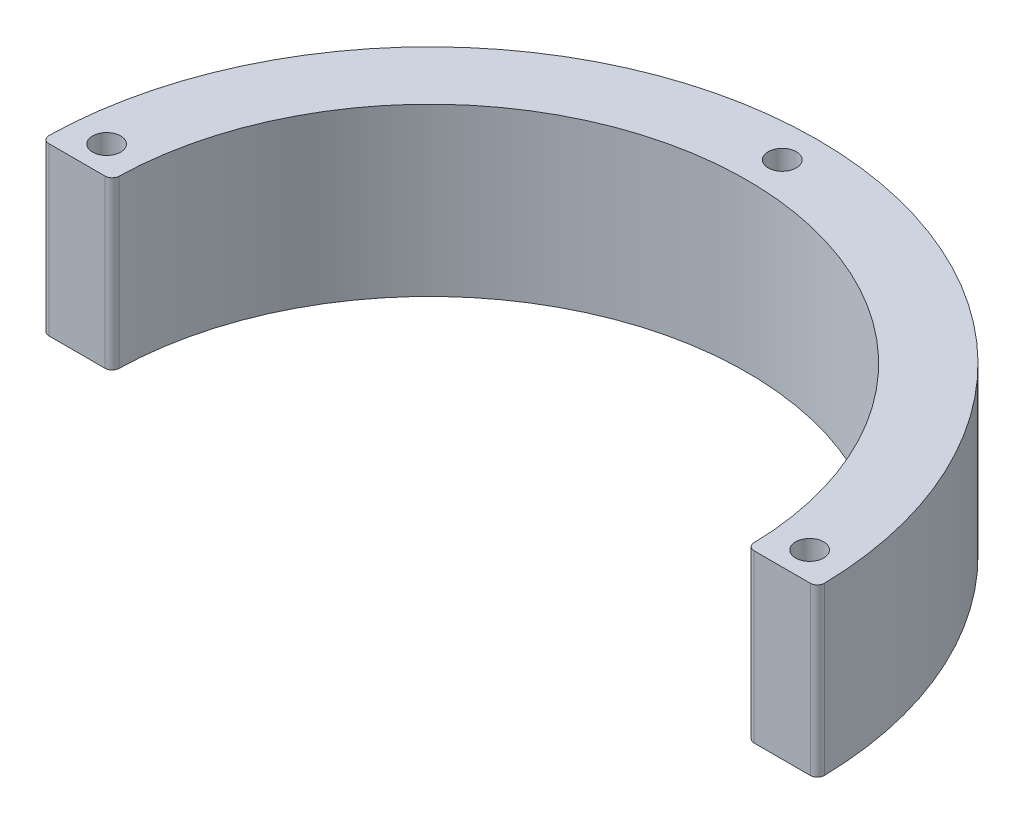
ISO-10303-21;
HEADER;
FILE_DESCRIPTION(('STEP AP214'),'2;1');
FILE_NAME('part.step','',(''),(''),'','','');
FILE_SCHEMA(('AUTOMOTIVE_DESIGN { 1 0 10303 214 1 1 1 1 }'));
ENDSEC;
DATA;
#1=APPLICATION_CONTEXT('core data for automotive mechanical design processes');
#2=APPLICATION_PROTOCOL_DEFINITION('international standard','automotive_design',2000,#1);
#3=PRODUCT_CONTEXT('',#1,'mechanical');
#4=PRODUCT('Part','Part','',(#3));
#5=PRODUCT_RELATED_PRODUCT_CATEGORY('part','',(#4));
#6=PRODUCT_DEFINITION_FORMATION('','',#4);
#7=PRODUCT_DEFINITION_CONTEXT('part definition',#1,'design');
#8=PRODUCT_DEFINITION('design','',#6,#7);
#9=PRODUCT_DEFINITION_SHAPE('','',#8);
#10=(LENGTH_UNIT() NAMED_UNIT(*) SI_UNIT(.MILLI.,.METRE.));
#11=(NAMED_UNIT(*) PLANE_ANGLE_UNIT() SI_UNIT($,.RADIAN.));
#12=(NAMED_UNIT(*) SI_UNIT($,.STERADIAN.) SOLID_ANGLE_UNIT());
#13=UNCERTAINTY_MEASURE_WITH_UNIT(LENGTH_MEASURE(1.E-05),#10,'distance_accuracy_value','');
#14=(GEOMETRIC_REPRESENTATION_CONTEXT(3) GLOBAL_UNCERTAINTY_ASSIGNED_CONTEXT((#13)) GLOBAL_UNIT_ASSIGNED_CONTEXT((#10,
#11,#12)) REPRESENTATION_CONTEXT('',''));
#15=CARTESIAN_POINT('',(0.,0.,0.));
#16=DIRECTION('',(0.,0.,1.));
#17=DIRECTION('',(1.,0.,0.));
#18=AXIS2_PLACEMENT_3D('',#15,#16,#17);
#19=CARTESIAN_POINT('',(0.,11.85,0.));
#20=DIRECTION('',(0.,-1.,0.));
#21=DIRECTION('',(0.,0.,-1.));
#22=AXIS2_PLACEMENT_3D('',#19,#20,#21);
#23=CYLINDRICAL_SURFACE('',#22,22.6);
#24=CARTESIAN_POINT('',(0.,0.,0.));
#25=DIRECTION('',(0.,-1.,0.));
#26=DIRECTION('',(0.,0.,1.));
#27=AXIS2_PLACEMENT_3D('',#24,#25,#26);
#28=CIRCLE('',#27,22.6);
#29=CARTESIAN_POINT('',(-22.5947052510999,0.,-0.489177489177489));
#30=VERTEX_POINT('',#29);
#31=CARTESIAN_POINT('',(22.5947052510999,0.,-0.489177489177489));
#32=VERTEX_POINT('',#31);
#33=EDGE_CURVE('E131',#30,#32,#28,.T.);
#34=ORIENTED_EDGE('',*,*,#33,.T.);
#35=DIRECTION('',(0.,-1.,0.));
#36=VECTOR('',#35,1.);
#37=CARTESIAN_POINT('',(22.5947052510999,11.85,-0.489177489177489));
#38=LINE('',#37,#36);
#39=CARTESIAN_POINT('',(22.5947052510999,11.85,-0.489177489177489));
#40=VERTEX_POINT('',#39);
#41=EDGE_CURVE('E154',#32,#40,#38,.F.);
#42=ORIENTED_EDGE('',*,*,#41,.T.);
#43=CARTESIAN_POINT('',(0.,11.85,0.));
#44=DIRECTION('',(0.,-1.,0.));
#45=DIRECTION('',(0.,0.,1.));
#46=AXIS2_PLACEMENT_3D('',#43,#44,#45);
#47=CIRCLE('',#46,22.6);
#48=CARTESIAN_POINT('',(-22.5947052510999,11.85,-0.489177489177489));
#49=VERTEX_POINT('',#48);
#50=EDGE_CURVE('E129',#49,#40,#47,.T.);
#51=ORIENTED_EDGE('',*,*,#50,.F.);
#52=DIRECTION('',(0.,-1.,0.));
#53=VECTOR('',#52,1.);
#54=CARTESIAN_POINT('',(-22.5947052510999,11.85,-0.489177489177489));
#55=LINE('',#54,#53);
#56=EDGE_CURVE('E151',#49,#30,#55,.T.);
#57=ORIENTED_EDGE('',*,*,#56,.T.);
#58=EDGE_LOOP('',(#34,#42,#51,#57));
#59=FACE_BOUND('',#58,.T.);
#60=ADVANCED_FACE('F36',(#59),#23,.F.);
#61=CARTESIAN_POINT('',(22.6,11.85,0.));
#62=DIRECTION('',(0.,0.,-1.));
#63=DIRECTION('',(-1.,0.,0.));
#64=AXIS2_PLACEMENT_3D('',#61,#62,#63);
#65=PLANE('',#64);
#66=DIRECTION('',(1.,0.,0.));
#67=VECTOR('',#66,1.);
#68=CARTESIAN_POINT('',(22.6,0.,0.));
#69=LINE('',#68,#67);
#70=CARTESIAN_POINT('',(23.0945881106375,0.,0.));
#71=VERTEX_POINT('',#70);
#72=CARTESIAN_POINT('',(27.0953870612693,0.,0.));
#73=VERTEX_POINT('',#72);
#74=EDGE_CURVE('E127',#71,#73,#69,.T.);
#75=ORIENTED_EDGE('',*,*,#74,.T.);
#76=DIRECTION('',(0.,-1.,0.));
#77=VECTOR('',#76,1.);
#78=CARTESIAN_POINT('',(27.0953870612693,11.85,0.));
#79=LINE('',#78,#77);
#80=CARTESIAN_POINT('',(27.0953870612693,11.85,0.));
#81=VERTEX_POINT('',#80);
#82=EDGE_CURVE('E106',#73,#81,#79,.F.);
#83=ORIENTED_EDGE('',*,*,#82,.T.);
#84=DIRECTION('',(1.,0.,0.));
#85=VECTOR('',#84,1.);
#86=CARTESIAN_POINT('',(22.6,11.85,0.));
#87=LINE('',#86,#85);
#88=CARTESIAN_POINT('',(23.0945881106375,11.85,0.));
#89=VERTEX_POINT('',#88);
#90=EDGE_CURVE('E170',#89,#81,#87,.T.);
#91=ORIENTED_EDGE('',*,*,#90,.F.);
#92=DIRECTION('',(0.,-1.,0.));
#93=VECTOR('',#92,1.);
#94=CARTESIAN_POINT('',(23.0945881106375,11.85,0.));
#95=LINE('',#94,#93);
#96=EDGE_CURVE('E111',#89,#71,#95,.T.);
#97=ORIENTED_EDGE('',*,*,#96,.T.);
#98=EDGE_LOOP('',(#75,#83,#91,#97));
#99=FACE_BOUND('',#98,.T.);
#100=ADVANCED_FACE('F209',(#99),#65,.F.);
#101=CARTESIAN_POINT('',(0.,11.85,0.));
#102=DIRECTION('',(0.,-1.,0.));
#103=DIRECTION('',(0.,0.,-1.));
#104=AXIS2_PLACEMENT_3D('',#101,#102,#103);
#105=CYLINDRICAL_SURFACE('',#104,27.6);
#106=CARTESIAN_POINT('',(0.,11.85,0.));
#107=DIRECTION('',(0.,1.,0.));
#108=DIRECTION('',(0.,0.,1.));
#109=AXIS2_PLACEMENT_3D('',#106,#107,#108);
#110=CIRCLE('',#109,27.6);
#111=CARTESIAN_POINT('',(27.5953019516986,11.85,-0.509225092250922));
#112=VERTEX_POINT('',#111);
#113=CARTESIAN_POINT('',(-27.5953019516986,11.85,-0.509225092250922));
#114=VERTEX_POINT('',#113);
#115=EDGE_CURVE('E120',#112,#114,#110,.T.);
#116=ORIENTED_EDGE('',*,*,#115,.F.);
#117=DIRECTION('',(0.,-1.,0.));
#118=VECTOR('',#117,1.);
#119=CARTESIAN_POINT('',(27.5953019516986,11.85,-0.509225092250923));
#120=LINE('',#119,#118);
#121=CARTESIAN_POINT('',(27.5953019516986,0.,-0.509225092250922));
#122=VERTEX_POINT('',#121);
#123=EDGE_CURVE('E105',#112,#122,#120,.T.);
#124=ORIENTED_EDGE('',*,*,#123,.T.);
#125=CARTESIAN_POINT('',(0.,0.,0.));
#126=DIRECTION('',(0.,1.,0.));
#127=DIRECTION('',(0.,0.,1.));
#128=AXIS2_PLACEMENT_3D('',#125,#126,#127);
#129=CIRCLE('',#128,27.6);
#130=CARTESIAN_POINT('',(-27.5953019516986,0.,-0.509225092250922));
#131=VERTEX_POINT('',#130);
#132=EDGE_CURVE('E118',#122,#131,#129,.T.);
#133=ORIENTED_EDGE('',*,*,#132,.T.);
#134=DIRECTION('',(0.,-1.,0.));
#135=VECTOR('',#134,1.);
#136=CARTESIAN_POINT('',(-27.5953019516986,11.85,-0.509225092250923));
#137=LINE('',#136,#135);
#138=EDGE_CURVE('E122',#131,#114,#137,.F.);
#139=ORIENTED_EDGE('',*,*,#138,.T.);
#140=EDGE_LOOP('',(#116,#124,#133,#139));
#141=FACE_BOUND('',#140,.T.);
#142=ADVANCED_FACE('F117',(#141),#105,.T.);
#143=CARTESIAN_POINT('',(-27.6,11.85,0.));
#144=DIRECTION('',(0.,0.,-1.));
#145=DIRECTION('',(-1.,0.,0.));
#146=AXIS2_PLACEMENT_3D('',#143,#144,#145);
#147=PLANE('',#146);
#148=DIRECTION('',(1.,0.,0.));
#149=VECTOR('',#148,1.);
#150=CARTESIAN_POINT('',(-27.6,0.,0.));
#151=LINE('',#150,#149);
#152=CARTESIAN_POINT('',(-27.0953870612693,0.,0.));
#153=VERTEX_POINT('',#152);
#154=CARTESIAN_POINT('',(-23.0945881106375,0.,0.));
#155=VERTEX_POINT('',#154);
#156=EDGE_CURVE('E126',#153,#155,#151,.T.);
#157=ORIENTED_EDGE('',*,*,#156,.T.);
#158=DIRECTION('',(0.,-1.,0.));
#159=VECTOR('',#158,1.);
#160=CARTESIAN_POINT('',(-23.0945881106375,11.85,0.));
#161=LINE('',#160,#159);
#162=CARTESIAN_POINT('',(-23.0945881106375,11.85,0.));
#163=VERTEX_POINT('',#162);
#164=EDGE_CURVE('E11',#155,#163,#161,.F.);
#165=ORIENTED_EDGE('',*,*,#164,.T.);
#166=DIRECTION('',(1.,0.,0.));
#167=VECTOR('',#166,1.);
#168=CARTESIAN_POINT('',(-27.6,11.85,0.));
#169=LINE('',#168,#167);
#170=CARTESIAN_POINT('',(-27.0953870612693,11.85,0.));
#171=VERTEX_POINT('',#170);
#172=EDGE_CURVE('E135',#171,#163,#169,.T.);
#173=ORIENTED_EDGE('',*,*,#172,.F.);
#174=DIRECTION('',(0.,-1.,0.));
#175=VECTOR('',#174,1.);
#176=CARTESIAN_POINT('',(-27.0953870612693,11.85,0.));
#177=LINE('',#176,#175);
#178=EDGE_CURVE('E44',#171,#153,#177,.T.);
#179=ORIENTED_EDGE('',*,*,#178,.T.);
#180=EDGE_LOOP('',(#157,#165,#173,#179));
#181=FACE_BOUND('',#180,.T.);
#182=ADVANCED_FACE('F157',(#181),#147,.F.);
#183=CARTESIAN_POINT('',(0.,11.85,0.));
#184=DIRECTION('',(0.,1.,0.));
#185=DIRECTION('',(0.,0.,1.));
#186=AXIS2_PLACEMENT_3D('',#183,#184,#185);
#187=PLANE('',#186);
#188=CARTESIAN_POINT('',(-25.0177384181239,11.85,-2.03045917031813));
#189=DIRECTION('',(0.,1.,0.));
#190=DIRECTION('',(0.,0.,1.));
#191=AXIS2_PLACEMENT_3D('',#188,#189,#190);
#192=CIRCLE('',#191,1.);
#193=CARTESIAN_POINT('',(-25.0177384181239,11.85,-1.03045917031813));
#194=VERTEX_POINT('',#193);
#195=EDGE_CURVE('E181',#194,#194,#192,.T.);
#196=ORIENTED_EDGE('',*,*,#195,.F.);
#197=EDGE_LOOP('',(#196));
#198=FACE_BOUND('',#197,.T.);
#199=CARTESIAN_POINT('',(25.0177384181239,11.85,-2.03045917031804));
#200=DIRECTION('',(0.,1.,0.));
#201=DIRECTION('',(0.,0.,1.));
#202=AXIS2_PLACEMENT_3D('',#199,#200,#201);
#203=CIRCLE('',#202,1.);
#204=CARTESIAN_POINT('',(25.0177384181239,11.85,-1.03045917031804));
#205=VERTEX_POINT('',#204);
#206=EDGE_CURVE('E191',#205,#205,#203,.T.);
#207=ORIENTED_EDGE('',*,*,#206,.F.);
#208=EDGE_LOOP('',(#207));
#209=FACE_BOUND('',#208,.T.);
#210=CARTESIAN_POINT('',(0.,11.85,-25.1));
#211=DIRECTION('',(0.,1.,0.));
#212=DIRECTION('',(0.,0.,1.));
#213=AXIS2_PLACEMENT_3D('',#210,#211,#212);
#214=CIRCLE('',#213,1.);
#215=CARTESIAN_POINT('',(0.,11.85,-24.1));
#216=VERTEX_POINT('',#215);
#217=EDGE_CURVE('E175',#216,#216,#214,.T.);
#218=ORIENTED_EDGE('',*,*,#217,.F.);
#219=EDGE_LOOP('',(#218));
#220=FACE_BOUND('',#219,.T.);
#221=ORIENTED_EDGE('',*,*,#90,.T.);
#222=CARTESIAN_POINT('',(27.0953870612693,11.85,-0.5));
#223=DIRECTION('',(0.,1.,0.));
#224=DIRECTION('',(0.,0.,1.));
#225=AXIS2_PLACEMENT_3D('',#222,#223,#224);
#226=CIRCLE('',#225,0.5);
#227=EDGE_CURVE('E149',#81,#112,#226,.T.);
#228=ORIENTED_EDGE('',*,*,#227,.T.);
#229=ORIENTED_EDGE('',*,*,#115,.T.);
#230=CARTESIAN_POINT('',(-27.0953870612693,11.85,-0.5));
#231=DIRECTION('',(0.,1.,0.));
#232=DIRECTION('',(0.,0.,1.));
#233=AXIS2_PLACEMENT_3D('',#230,#231,#232);
#234=CIRCLE('',#233,0.5);
#235=EDGE_CURVE('E56',#114,#171,#234,.T.);
#236=ORIENTED_EDGE('',*,*,#235,.T.);
#237=ORIENTED_EDGE('',*,*,#172,.T.);
#238=CARTESIAN_POINT('',(-23.0945881106375,11.85,-0.5));
#239=DIRECTION('',(0.,1.,0.));
#240=DIRECTION('',(0.,0.,1.));
#241=AXIS2_PLACEMENT_3D('',#238,#239,#240);
#242=CIRCLE('',#241,0.5);
#243=EDGE_CURVE('E145',#163,#49,#242,.T.);
#244=ORIENTED_EDGE('',*,*,#243,.T.);
#245=ORIENTED_EDGE('',*,*,#50,.T.);
#246=CARTESIAN_POINT('',(23.0945881106375,11.85,-0.5));
#247=DIRECTION('',(0.,1.,0.));
#248=DIRECTION('',(0.,0.,1.));
#249=AXIS2_PLACEMENT_3D('',#246,#247,#248);
#250=CIRCLE('',#249,0.5);
#251=EDGE_CURVE('E147',#40,#89,#250,.T.);
#252=ORIENTED_EDGE('',*,*,#251,.T.);
#253=EDGE_LOOP('',(#221,#228,#229,#236,#237,#244,#245,#252));
#254=FACE_BOUND('',#253,.T.);
#255=ADVANCED_FACE('F202',(#198,#209,#220,#254),#187,.T.);
#256=CARTESIAN_POINT('',(0.,0.,0.));
#257=DIRECTION('',(0.,1.,0.));
#258=DIRECTION('',(0.,0.,1.));
#259=AXIS2_PLACEMENT_3D('',#256,#257,#258);
#260=PLANE('',#259);
#261=CARTESIAN_POINT('',(-25.0177384181239,0.,-2.03045917031813));
#262=DIRECTION('',(0.,1.,0.));
#263=DIRECTION('',(0.,0.,1.));
#264=AXIS2_PLACEMENT_3D('',#261,#262,#263);
#265=CIRCLE('',#264,1.);
#266=CARTESIAN_POINT('',(-25.0177384181239,0.,-1.03045917031813));
#267=VERTEX_POINT('',#266);
#268=EDGE_CURVE('E179',#267,#267,#265,.T.);
#269=ORIENTED_EDGE('',*,*,#268,.T.);
#270=EDGE_LOOP('',(#269));
#271=FACE_BOUND('',#270,.T.);
#272=CARTESIAN_POINT('',(25.0177384181239,0.,-2.03045917031804));
#273=DIRECTION('',(0.,1.,0.));
#274=DIRECTION('',(0.,0.,1.));
#275=AXIS2_PLACEMENT_3D('',#272,#273,#274);
#276=CIRCLE('',#275,1.);
#277=CARTESIAN_POINT('',(25.0177384181239,0.,-1.03045917031804));
#278=VERTEX_POINT('',#277);
#279=EDGE_CURVE('E186',#278,#278,#276,.T.);
#280=ORIENTED_EDGE('',*,*,#279,.T.);
#281=EDGE_LOOP('',(#280));
#282=FACE_BOUND('',#281,.T.);
#283=CARTESIAN_POINT('',(0.,0.,-25.1));
#284=DIRECTION('',(0.,1.,0.));
#285=DIRECTION('',(0.,0.,1.));
#286=AXIS2_PLACEMENT_3D('',#283,#284,#285);
#287=CIRCLE('',#286,1.);
#288=CARTESIAN_POINT('',(0.,0.,-24.1));
#289=VERTEX_POINT('',#288);
#290=EDGE_CURVE('E193',#289,#289,#287,.T.);
#291=ORIENTED_EDGE('',*,*,#290,.T.);
#292=EDGE_LOOP('',(#291));
#293=FACE_BOUND('',#292,.T.);
#294=ORIENTED_EDGE('',*,*,#132,.F.);
#295=CARTESIAN_POINT('',(27.0953870612693,0.,-0.5));
#296=DIRECTION('',(0.,1.,0.));
#297=DIRECTION('',(0.,0.,1.));
#298=AXIS2_PLACEMENT_3D('',#295,#296,#297);
#299=CIRCLE('',#298,0.5);
#300=EDGE_CURVE('E101',#122,#73,#299,.F.);
#301=ORIENTED_EDGE('',*,*,#300,.T.);
#302=ORIENTED_EDGE('',*,*,#74,.F.);
#303=CARTESIAN_POINT('',(23.0945881106375,0.,-0.5));
#304=DIRECTION('',(0.,1.,0.));
#305=DIRECTION('',(0.,0.,1.));
#306=AXIS2_PLACEMENT_3D('',#303,#304,#305);
#307=CIRCLE('',#306,0.5);
#308=EDGE_CURVE('E112',#71,#32,#307,.F.);
#309=ORIENTED_EDGE('',*,*,#308,.T.);
#310=ORIENTED_EDGE('',*,*,#33,.F.);
#311=CARTESIAN_POINT('',(-23.0945881106375,0.,-0.5));
#312=DIRECTION('',(0.,1.,0.));
#313=DIRECTION('',(0.,0.,1.));
#314=AXIS2_PLACEMENT_3D('',#311,#312,#313);
#315=CIRCLE('',#314,0.5);
#316=EDGE_CURVE('E138',#30,#155,#315,.F.);
#317=ORIENTED_EDGE('',*,*,#316,.T.);
#318=ORIENTED_EDGE('',*,*,#156,.F.);
#319=CARTESIAN_POINT('',(-27.0953870612693,0.,-0.5));
#320=DIRECTION('',(0.,1.,0.));
#321=DIRECTION('',(0.,0.,1.));
#322=AXIS2_PLACEMENT_3D('',#319,#320,#321);
#323=CIRCLE('',#322,0.5);
#324=EDGE_CURVE('E121',#153,#131,#323,.F.);
#325=ORIENTED_EDGE('',*,*,#324,.T.);
#326=EDGE_LOOP('',(#294,#301,#302,#309,#310,#317,#318,#325));
#327=FACE_BOUND('',#326,.T.);
#328=ADVANCED_FACE('F124',(#271,#282,#293,#327),#260,.F.);
#329=CARTESIAN_POINT('',(0.,0.,-25.1));
#330=DIRECTION('',(0.,1.,0.));
#331=DIRECTION('',(0.,0.,1.));
#332=AXIS2_PLACEMENT_3D('',#329,#330,#331);
#333=CYLINDRICAL_SURFACE('',#332,1.);
#334=ORIENTED_EDGE('',*,*,#290,.F.);
#335=EDGE_LOOP('',(#334));
#336=FACE_BOUND('',#335,.T.);
#337=ORIENTED_EDGE('',*,*,#217,.T.);
#338=EDGE_LOOP('',(#337));
#339=FACE_BOUND('',#338,.T.);
#340=ADVANCED_FACE('F200',(#336,#339),#333,.F.);
#341=CARTESIAN_POINT('',(25.0177384181239,0.,-2.03045917031804));
#342=DIRECTION('',(0.,1.,0.));
#343=DIRECTION('',(0.,0.,1.));
#344=AXIS2_PLACEMENT_3D('',#341,#342,#343);
#345=CYLINDRICAL_SURFACE('',#344,1.);
#346=ORIENTED_EDGE('',*,*,#279,.F.);
#347=EDGE_LOOP('',(#346));
#348=FACE_BOUND('',#347,.T.);
#349=ORIENTED_EDGE('',*,*,#206,.T.);
#350=EDGE_LOOP('',(#349));
#351=FACE_BOUND('',#350,.T.);
#352=ADVANCED_FACE('F235',(#348,#351),#345,.F.);
#353=CARTESIAN_POINT('',(-25.0177384181239,0.,-2.03045917031813));
#354=DIRECTION('',(0.,1.,0.));
#355=DIRECTION('',(0.,0.,1.));
#356=AXIS2_PLACEMENT_3D('',#353,#354,#355);
#357=CYLINDRICAL_SURFACE('',#356,1.);
#358=ORIENTED_EDGE('',*,*,#268,.F.);
#359=EDGE_LOOP('',(#358));
#360=FACE_BOUND('',#359,.T.);
#361=ORIENTED_EDGE('',*,*,#195,.T.);
#362=EDGE_LOOP('',(#361));
#363=FACE_BOUND('',#362,.T.);
#364=ADVANCED_FACE('F218',(#360,#363),#357,.F.);
#365=CARTESIAN_POINT('',(27.0953870612693,11.85,-0.5));
#366=DIRECTION('',(0.,-1.,0.));
#367=DIRECTION('',(0.,0.,-1.));
#368=AXIS2_PLACEMENT_3D('',#365,#366,#367);
#369=CYLINDRICAL_SURFACE('',#368,0.5);
#370=ORIENTED_EDGE('',*,*,#227,.F.);
#371=ORIENTED_EDGE('',*,*,#82,.F.);
#372=ORIENTED_EDGE('',*,*,#300,.F.);
#373=ORIENTED_EDGE('',*,*,#123,.F.);
#374=EDGE_LOOP('',(#370,#371,#372,#373));
#375=FACE_BOUND('',#374,.T.);
#376=ADVANCED_FACE('F104',(#375),#369,.T.);
#377=CARTESIAN_POINT('',(23.0945881106375,11.85,-0.5));
#378=DIRECTION('',(0.,-1.,0.));
#379=DIRECTION('',(0.,0.,-1.));
#380=AXIS2_PLACEMENT_3D('',#377,#378,#379);
#381=CYLINDRICAL_SURFACE('',#380,0.5);
#382=ORIENTED_EDGE('',*,*,#251,.F.);
#383=ORIENTED_EDGE('',*,*,#41,.F.);
#384=ORIENTED_EDGE('',*,*,#308,.F.);
#385=ORIENTED_EDGE('',*,*,#96,.F.);
#386=EDGE_LOOP('',(#382,#383,#384,#385));
#387=FACE_BOUND('',#386,.T.);
#388=ADVANCED_FACE('F211',(#387),#381,.T.);
#389=CARTESIAN_POINT('',(-23.0945881106375,11.85,-0.5));
#390=DIRECTION('',(0.,-1.,0.));
#391=DIRECTION('',(0.,0.,-1.));
#392=AXIS2_PLACEMENT_3D('',#389,#390,#391);
#393=CYLINDRICAL_SURFACE('',#392,0.5);
#394=ORIENTED_EDGE('',*,*,#243,.F.);
#395=ORIENTED_EDGE('',*,*,#164,.F.);
#396=ORIENTED_EDGE('',*,*,#316,.F.);
#397=ORIENTED_EDGE('',*,*,#56,.F.);
#398=EDGE_LOOP('',(#394,#395,#396,#397));
#399=FACE_BOUND('',#398,.T.);
#400=ADVANCED_FACE('F164',(#399),#393,.T.);
#401=CARTESIAN_POINT('',(-27.0953870612693,11.85,-0.5));
#402=DIRECTION('',(0.,-1.,0.));
#403=DIRECTION('',(0.,0.,-1.));
#404=AXIS2_PLACEMENT_3D('',#401,#402,#403);
#405=CYLINDRICAL_SURFACE('',#404,0.5);
#406=ORIENTED_EDGE('',*,*,#235,.F.);
#407=ORIENTED_EDGE('',*,*,#138,.F.);
#408=ORIENTED_EDGE('',*,*,#324,.F.);
#409=ORIENTED_EDGE('',*,*,#178,.F.);
#410=EDGE_LOOP('',(#406,#407,#408,#409));
#411=FACE_BOUND('',#410,.T.);
#412=ADVANCED_FACE('F38',(#411),#405,.T.);
#413=CLOSED_SHELL('',(#60,#100,#142,#182,#255,#328,#340,#352,#364,#376,#388,#400,#412));
#414=MANIFOLD_SOLID_BREP('B2',#413);
#415=ADVANCED_BREP_SHAPE_REPRESENTATION('',(#18,#414),#14);
#416=SHAPE_DEFINITION_REPRESENTATION(#9,#415);
ENDSEC;
END-ISO-10303-21;
